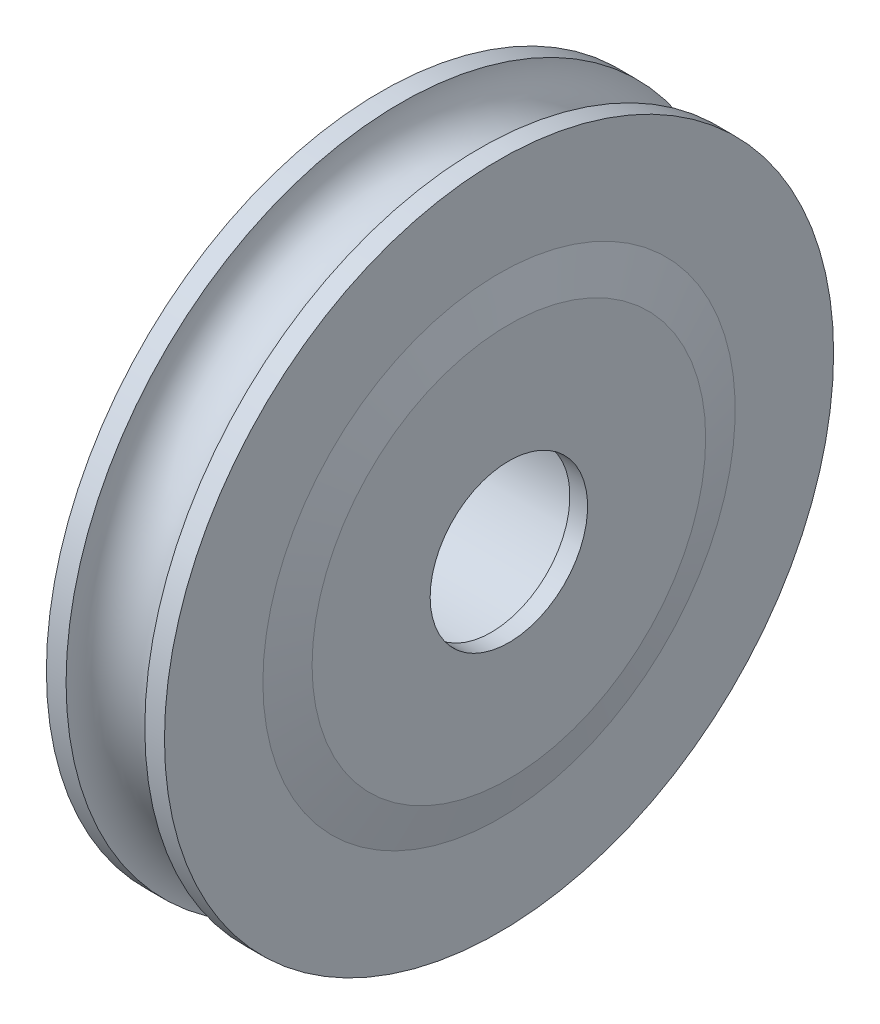
ISO-10303-21;
HEADER;
FILE_DESCRIPTION(('STEP AP214'),'2;1');
FILE_NAME('part.step','',(''),(''),'','','');
FILE_SCHEMA(('AUTOMOTIVE_DESIGN { 1 0 10303 214 1 1 1 1 }'));
ENDSEC;
DATA;
#1=APPLICATION_CONTEXT('core data for automotive mechanical design processes');
#2=APPLICATION_PROTOCOL_DEFINITION('international standard','automotive_design',2000,#1);
#3=PRODUCT_CONTEXT('',#1,'mechanical');
#4=PRODUCT('Part','Part','',(#3));
#5=PRODUCT_RELATED_PRODUCT_CATEGORY('part','',(#4));
#6=PRODUCT_DEFINITION_FORMATION('','',#4);
#7=PRODUCT_DEFINITION_CONTEXT('part definition',#1,'design');
#8=PRODUCT_DEFINITION('design','',#6,#7);
#9=PRODUCT_DEFINITION_SHAPE('','',#8);
#10=(LENGTH_UNIT() NAMED_UNIT(*) SI_UNIT(.MILLI.,.METRE.));
#11=(NAMED_UNIT(*) PLANE_ANGLE_UNIT() SI_UNIT($,.RADIAN.));
#12=(NAMED_UNIT(*) SI_UNIT($,.STERADIAN.) SOLID_ANGLE_UNIT());
#13=UNCERTAINTY_MEASURE_WITH_UNIT(LENGTH_MEASURE(1.E-05),#10,'distance_accuracy_value','');
#14=(GEOMETRIC_REPRESENTATION_CONTEXT(3) GLOBAL_UNCERTAINTY_ASSIGNED_CONTEXT((#13)) GLOBAL_UNIT_ASSIGNED_CONTEXT((#10,
#11,#12)) REPRESENTATION_CONTEXT('',''));
#15=CARTESIAN_POINT('',(0.,0.,0.));
#16=DIRECTION('',(0.,0.,1.));
#17=DIRECTION('',(1.,0.,0.));
#18=AXIS2_PLACEMENT_3D('',#15,#16,#17);
#19=CARTESIAN_POINT('',(0.,0.,0.));
#20=DIRECTION('',(-1.,0.,0.));
#21=DIRECTION('',(0.,0.,1.));
#22=AXIS2_PLACEMENT_3D('',#19,#20,#21);
#23=CYLINDRICAL_SURFACE('',#22,4.);
#24=CARTESIAN_POINT('',(6.5,0.,0.));
#25=DIRECTION('',(-1.,0.,0.));
#26=DIRECTION('',(0.,0.,1.));
#27=AXIS2_PLACEMENT_3D('',#24,#25,#26);
#28=CIRCLE('',#27,4.);
#29=CARTESIAN_POINT('',(6.5,0.,4.));
#30=VERTEX_POINT('',#29);
#31=EDGE_CURVE('E10',#30,#30,#28,.T.);
#32=ORIENTED_EDGE('',*,*,#31,.F.);
#33=EDGE_LOOP('',(#32));
#34=FACE_BOUND('',#33,.T.);
#35=CARTESIAN_POINT('',(5.6,0.,0.));
#36=DIRECTION('',(-1.,0.,0.));
#37=DIRECTION('',(0.,0.,1.));
#38=AXIS2_PLACEMENT_3D('',#35,#36,#37);
#39=CIRCLE('',#38,4.);
#40=CARTESIAN_POINT('',(5.6,0.,4.));
#41=VERTEX_POINT('',#40);
#42=EDGE_CURVE('E69',#41,#41,#39,.T.);
#43=ORIENTED_EDGE('',*,*,#42,.T.);
#44=EDGE_LOOP('',(#43));
#45=FACE_BOUND('',#44,.T.);
#46=ADVANCED_FACE('F35',(#34,#45),#23,.F.);
#47=CARTESIAN_POINT('',(6.5,10.,0.));
#48=DIRECTION('',(-1.,0.,0.));
#49=DIRECTION('',(0.,0.,1.));
#50=AXIS2_PLACEMENT_3D('',#47,#48,#49);
#51=PLANE('',#50);
#52=CARTESIAN_POINT('',(6.5,0.,0.));
#53=DIRECTION('',(-1.,0.,0.));
#54=DIRECTION('',(0.,0.,1.));
#55=AXIS2_PLACEMENT_3D('',#52,#53,#54);
#56=CIRCLE('',#55,10.);
#57=CARTESIAN_POINT('',(6.5,0.,10.));
#58=VERTEX_POINT('',#57);
#59=EDGE_CURVE('E41',#58,#58,#56,.T.);
#60=ORIENTED_EDGE('',*,*,#59,.F.);
#61=EDGE_LOOP('',(#60));
#62=FACE_BOUND('',#61,.T.);
#63=ORIENTED_EDGE('',*,*,#31,.T.);
#64=EDGE_LOOP('',(#63));
#65=FACE_BOUND('',#64,.T.);
#66=ADVANCED_FACE('F118',(#62,#65),#51,.F.);
#67=CARTESIAN_POINT('',(6.5,0.,0.));
#68=DIRECTION('',(-1.,0.,0.));
#69=DIRECTION('',(0.,0.,1.));
#70=AXIS2_PLACEMENT_3D('',#67,#68,#69);
#71=CONICAL_SURFACE('',#70,10.,1.32581766366803);
#72=CARTESIAN_POINT('',(6.,0.,0.));
#73=DIRECTION('',(-1.,0.,0.));
#74=DIRECTION('',(0.,0.,1.));
#75=AXIS2_PLACEMENT_3D('',#72,#73,#74);
#76=CIRCLE('',#75,12.);
#77=CARTESIAN_POINT('',(6.,0.,12.));
#78=VERTEX_POINT('',#77);
#79=EDGE_CURVE('E45',#78,#78,#76,.T.);
#80=ORIENTED_EDGE('',*,*,#79,.F.);
#81=EDGE_LOOP('',(#80));
#82=FACE_BOUND('',#81,.T.);
#83=ORIENTED_EDGE('',*,*,#59,.T.);
#84=EDGE_LOOP('',(#83));
#85=FACE_BOUND('',#84,.T.);
#86=ADVANCED_FACE('F113',(#82,#85),#71,.T.);
#87=CARTESIAN_POINT('',(6.,17.,0.));
#88=DIRECTION('',(-1.,0.,0.));
#89=DIRECTION('',(0.,0.,1.));
#90=AXIS2_PLACEMENT_3D('',#87,#88,#89);
#91=PLANE('',#90);
#92=CARTESIAN_POINT('',(6.,0.,0.));
#93=DIRECTION('',(-1.,0.,0.));
#94=DIRECTION('',(0.,0.,1.));
#95=AXIS2_PLACEMENT_3D('',#92,#93,#94);
#96=CIRCLE('',#95,17.);
#97=CARTESIAN_POINT('',(6.,0.,17.));
#98=VERTEX_POINT('',#97);
#99=EDGE_CURVE('E49',#98,#98,#96,.T.);
#100=ORIENTED_EDGE('',*,*,#99,.F.);
#101=EDGE_LOOP('',(#100));
#102=FACE_BOUND('',#101,.T.);
#103=ORIENTED_EDGE('',*,*,#79,.T.);
#104=EDGE_LOOP('',(#103));
#105=FACE_BOUND('',#104,.T.);
#106=ADVANCED_FACE('F107',(#102,#105),#91,.F.);
#107=CARTESIAN_POINT('',(0.,0.,0.));
#108=DIRECTION('',(-1.,0.,0.));
#109=DIRECTION('',(0.,0.,1.));
#110=AXIS2_PLACEMENT_3D('',#107,#108,#109);
#111=CYLINDRICAL_SURFACE('',#110,17.);
#112=CARTESIAN_POINT('',(5.,0.,0.));
#113=DIRECTION('',(-1.,0.,0.));
#114=DIRECTION('',(0.,0.,1.));
#115=AXIS2_PLACEMENT_3D('',#112,#113,#114);
#116=CIRCLE('',#115,17.);
#117=CARTESIAN_POINT('',(5.,0.,17.));
#118=VERTEX_POINT('',#117);
#119=EDGE_CURVE('E54',#118,#118,#116,.T.);
#120=ORIENTED_EDGE('',*,*,#119,.F.);
#121=EDGE_LOOP('',(#120));
#122=FACE_BOUND('',#121,.T.);
#123=ORIENTED_EDGE('',*,*,#99,.T.);
#124=EDGE_LOOP('',(#123));
#125=FACE_BOUND('',#124,.T.);
#126=ADVANCED_FACE('F101',(#122,#125),#111,.T.);
#127=CARTESIAN_POINT('',(3.,0.,0.));
#128=DIRECTION('',(-1.,0.,0.));
#129=DIRECTION('',(0.,0.,1.));
#130=AXIS2_PLACEMENT_3D('',#127,#128,#129);
#131=TOROIDAL_SURFACE('',#130,16.9901592764483,2.00002420981348);
#132=CARTESIAN_POINT('',(0.999999999999999,0.,0.));
#133=DIRECTION('',(-1.,0.,0.));
#134=DIRECTION('',(0.,0.,1.));
#135=AXIS2_PLACEMENT_3D('',#132,#133,#134);
#136=CIRCLE('',#135,17.);
#137=CARTESIAN_POINT('',(0.999999999999999,0.,17.));
#138=VERTEX_POINT('',#137);
#139=EDGE_CURVE('E57',#138,#138,#136,.T.);
#140=ORIENTED_EDGE('',*,*,#139,.F.);
#141=EDGE_LOOP('',(#140));
#142=FACE_BOUND('',#141,.T.);
#143=ORIENTED_EDGE('',*,*,#119,.T.);
#144=EDGE_LOOP('',(#143));
#145=FACE_BOUND('',#144,.T.);
#146=ADVANCED_FACE('F95',(#142,#145),#131,.F.);
#147=CARTESIAN_POINT('',(0.,0.,0.));
#148=DIRECTION('',(-1.,0.,0.));
#149=DIRECTION('',(0.,0.,1.));
#150=AXIS2_PLACEMENT_3D('',#147,#148,#149);
#151=CYLINDRICAL_SURFACE('',#150,17.);
#152=CARTESIAN_POINT('',(0.,0.,0.));
#153=DIRECTION('',(-1.,0.,0.));
#154=DIRECTION('',(0.,0.,1.));
#155=AXIS2_PLACEMENT_3D('',#152,#153,#154);
#156=CIRCLE('',#155,17.);
#157=CARTESIAN_POINT('',(0.,0.,17.));
#158=VERTEX_POINT('',#157);
#159=EDGE_CURVE('E60',#158,#158,#156,.T.);
#160=ORIENTED_EDGE('',*,*,#159,.F.);
#161=EDGE_LOOP('',(#160));
#162=FACE_BOUND('',#161,.T.);
#163=ORIENTED_EDGE('',*,*,#139,.T.);
#164=EDGE_LOOP('',(#163));
#165=FACE_BOUND('',#164,.T.);
#166=ADVANCED_FACE('F89',(#162,#165),#151,.T.);
#167=CARTESIAN_POINT('',(0.,17.,0.));
#168=DIRECTION('',(1.,0.,0.));
#169=DIRECTION('',(0.,0.,-1.));
#170=AXIS2_PLACEMENT_3D('',#167,#168,#169);
#171=PLANE('',#170);
#172=CARTESIAN_POINT('',(0.,0.,0.));
#173=DIRECTION('',(-1.,0.,0.));
#174=DIRECTION('',(0.,0.,1.));
#175=AXIS2_PLACEMENT_3D('',#172,#173,#174);
#176=CIRCLE('',#175,5.1);
#177=CARTESIAN_POINT('',(0.,0.,5.1));
#178=VERTEX_POINT('',#177);
#179=EDGE_CURVE('E63',#178,#178,#176,.T.);
#180=ORIENTED_EDGE('',*,*,#179,.F.);
#181=EDGE_LOOP('',(#180));
#182=FACE_BOUND('',#181,.T.);
#183=ORIENTED_EDGE('',*,*,#159,.T.);
#184=EDGE_LOOP('',(#183));
#185=FACE_BOUND('',#184,.T.);
#186=ADVANCED_FACE('F83',(#182,#185),#171,.F.);
#187=CARTESIAN_POINT('',(0.,0.,0.));
#188=DIRECTION('',(-1.,0.,0.));
#189=DIRECTION('',(0.,0.,1.));
#190=AXIS2_PLACEMENT_3D('',#187,#188,#189);
#191=CYLINDRICAL_SURFACE('',#190,5.1);
#192=CARTESIAN_POINT('',(5.6,0.,0.));
#193=DIRECTION('',(-1.,0.,0.));
#194=DIRECTION('',(0.,0.,1.));
#195=AXIS2_PLACEMENT_3D('',#192,#193,#194);
#196=CIRCLE('',#195,5.1);
#197=CARTESIAN_POINT('',(5.6,0.,5.1));
#198=VERTEX_POINT('',#197);
#199=EDGE_CURVE('E66',#198,#198,#196,.T.);
#200=ORIENTED_EDGE('',*,*,#199,.F.);
#201=EDGE_LOOP('',(#200));
#202=FACE_BOUND('',#201,.T.);
#203=ORIENTED_EDGE('',*,*,#179,.T.);
#204=EDGE_LOOP('',(#203));
#205=FACE_BOUND('',#204,.T.);
#206=ADVANCED_FACE('F77',(#202,#205),#191,.F.);
#207=CARTESIAN_POINT('',(5.6,5.1,0.));
#208=DIRECTION('',(1.,0.,0.));
#209=DIRECTION('',(0.,0.,-1.));
#210=AXIS2_PLACEMENT_3D('',#207,#208,#209);
#211=PLANE('',#210);
#212=ORIENTED_EDGE('',*,*,#42,.F.);
#213=EDGE_LOOP('',(#212));
#214=FACE_BOUND('',#213,.T.);
#215=ORIENTED_EDGE('',*,*,#199,.T.);
#216=EDGE_LOOP('',(#215));
#217=FACE_BOUND('',#216,.T.);
#218=ADVANCED_FACE('F74',(#214,#217),#211,.F.);
#219=CLOSED_SHELL('',(#46,#66,#86,#106,#126,#146,#166,#186,#206,#218));
#220=MANIFOLD_SOLID_BREP('B2',#219);
#221=ADVANCED_BREP_SHAPE_REPRESENTATION('',(#18,#220),#14);
#222=SHAPE_DEFINITION_REPRESENTATION(#9,#221);
ENDSEC;
END-ISO-10303-21;
